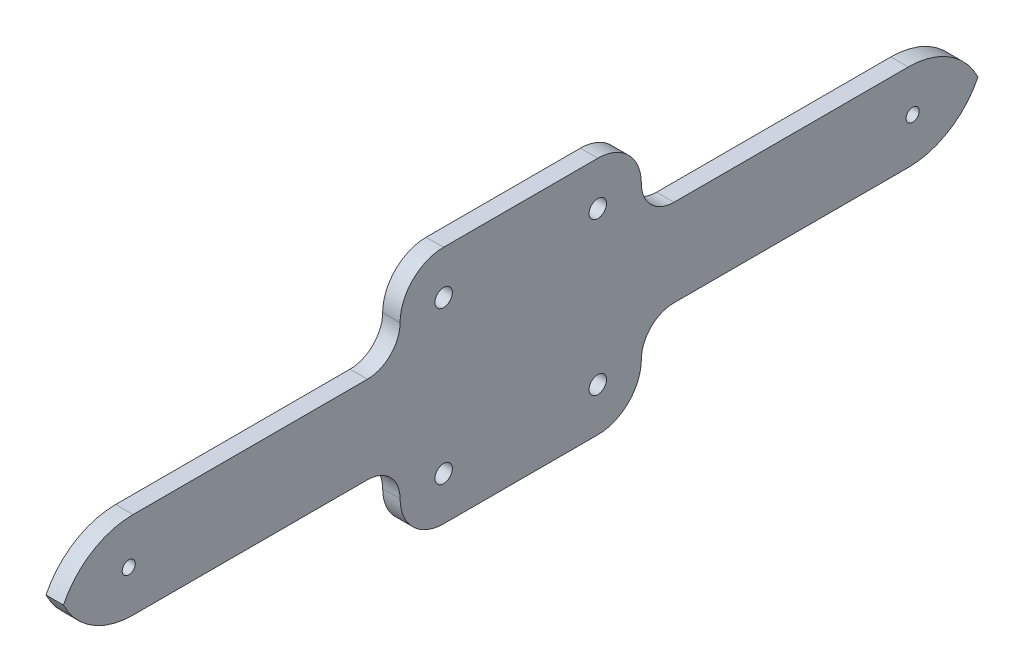
ISO-10303-21;
HEADER;
FILE_DESCRIPTION(('STEP AP214'),'2;1');
FILE_NAME('part.step','',(''),(''),'','','');
FILE_SCHEMA(('AUTOMOTIVE_DESIGN { 1 0 10303 214 1 1 1 1 }'));
ENDSEC;
DATA;
#1=APPLICATION_CONTEXT('core data for automotive mechanical design processes');
#2=APPLICATION_PROTOCOL_DEFINITION('international standard','automotive_design',2000,#1);
#3=PRODUCT_CONTEXT('',#1,'mechanical');
#4=PRODUCT('Part','Part','',(#3));
#5=PRODUCT_RELATED_PRODUCT_CATEGORY('part','',(#4));
#6=PRODUCT_DEFINITION_FORMATION('','',#4);
#7=PRODUCT_DEFINITION_CONTEXT('part definition',#1,'design');
#8=PRODUCT_DEFINITION('design','',#6,#7);
#9=PRODUCT_DEFINITION_SHAPE('','',#8);
#10=(LENGTH_UNIT() NAMED_UNIT(*) SI_UNIT(.MILLI.,.METRE.));
#11=(NAMED_UNIT(*) PLANE_ANGLE_UNIT() SI_UNIT($,.RADIAN.));
#12=(NAMED_UNIT(*) SI_UNIT($,.STERADIAN.) SOLID_ANGLE_UNIT());
#13=UNCERTAINTY_MEASURE_WITH_UNIT(LENGTH_MEASURE(1.E-05),#10,'distance_accuracy_value','');
#14=(GEOMETRIC_REPRESENTATION_CONTEXT(3) GLOBAL_UNCERTAINTY_ASSIGNED_CONTEXT((#13)) GLOBAL_UNIT_ASSIGNED_CONTEXT((#10,
#11,#12)) REPRESENTATION_CONTEXT('',''));
#15=CARTESIAN_POINT('',(0.,0.,0.));
#16=DIRECTION('',(0.,0.,1.));
#17=DIRECTION('',(1.,0.,0.));
#18=AXIS2_PLACEMENT_3D('',#15,#16,#17);
#19=CARTESIAN_POINT('',(4.,0.,0.));
#20=DIRECTION('',(1.,0.,0.));
#21=DIRECTION('',(0.,0.,-1.));
#22=AXIS2_PLACEMENT_3D('',#19,#20,#21);
#23=PLANE('',#22);
#24=CARTESIAN_POINT('',(4.,7.80000000000001,-89.));
#25=DIRECTION('',(-1.,0.,0.));
#26=DIRECTION('',(0.,0.,-1.));
#27=AXIS2_PLACEMENT_3D('',#24,#25,#26);
#28=CIRCLE('',#27,17.8);
#29=CARTESIAN_POINT('',(4.,0.,-105.));
#30=VERTEX_POINT('',#29);
#31=CARTESIAN_POINT('',(4.,-10.,-89.));
#32=VERTEX_POINT('',#31);
#33=EDGE_CURVE('E175',#30,#32,#28,.T.);
#34=ORIENTED_EDGE('',*,*,#33,.F.);
#35=CARTESIAN_POINT('',(4.,-7.80000000000001,-89.));
#36=DIRECTION('',(1.,0.,0.));
#37=DIRECTION('',(0.,0.,-1.));
#38=AXIS2_PLACEMENT_3D('',#35,#36,#37);
#39=CIRCLE('',#38,17.8);
#40=CARTESIAN_POINT('',(4.,10.,-89.));
#41=VERTEX_POINT('',#40);
#42=EDGE_CURVE('E218',#30,#41,#39,.T.);
#43=ORIENTED_EDGE('',*,*,#42,.T.);
#44=DIRECTION('',(0.,0.,1.));
#45=VECTOR('',#44,1.);
#46=CARTESIAN_POINT('',(4.,10.,-89.));
#47=LINE('',#46,#45);
#48=CARTESIAN_POINT('',(4.,10.,-35.2));
#49=VERTEX_POINT('',#48);
#50=EDGE_CURVE('E223',#41,#49,#47,.T.);
#51=ORIENTED_EDGE('',*,*,#50,.T.);
#52=CARTESIAN_POINT('',(4.,17.5,-35.2));
#53=DIRECTION('',(-1.,0.,0.));
#54=DIRECTION('',(0.,0.,1.));
#55=AXIS2_PLACEMENT_3D('',#52,#53,#54);
#56=CIRCLE('',#55,7.5);
#57=CARTESIAN_POINT('',(4.,17.5,-27.7));
#58=VERTEX_POINT('',#57);
#59=EDGE_CURVE('E236',#49,#58,#56,.T.);
#60=ORIENTED_EDGE('',*,*,#59,.T.);
#61=CARTESIAN_POINT('',(4.,17.5,-17.7));
#62=DIRECTION('',(1.,0.,0.));
#63=DIRECTION('',(0.,0.,1.));
#64=AXIS2_PLACEMENT_3D('',#61,#62,#63);
#65=CIRCLE('',#64,10.);
#66=CARTESIAN_POINT('',(4.,27.5,-17.7));
#67=VERTEX_POINT('',#66);
#68=EDGE_CURVE('E233',#58,#67,#65,.T.);
#69=ORIENTED_EDGE('',*,*,#68,.T.);
#70=DIRECTION('',(0.,0.,-1.));
#71=VECTOR('',#70,1.);
#72=CARTESIAN_POINT('',(4.,27.5,17.7));
#73=LINE('',#72,#71);
#74=CARTESIAN_POINT('',(4.,27.5,17.7));
#75=VERTEX_POINT('',#74);
#76=EDGE_CURVE('E305',#75,#67,#73,.T.);
#77=ORIENTED_EDGE('',*,*,#76,.F.);
#78=CARTESIAN_POINT('',(4.,17.5,17.7));
#79=DIRECTION('',(-1.,0.,0.));
#80=DIRECTION('',(0.,0.,-1.));
#81=AXIS2_PLACEMENT_3D('',#78,#79,#80);
#82=CIRCLE('',#81,10.);
#83=CARTESIAN_POINT('',(4.,17.5,27.7));
#84=VERTEX_POINT('',#83);
#85=EDGE_CURVE('E321',#84,#75,#82,.T.);
#86=ORIENTED_EDGE('',*,*,#85,.F.);
#87=CARTESIAN_POINT('',(4.,17.5,35.2));
#88=DIRECTION('',(1.,0.,0.));
#89=DIRECTION('',(0.,0.,-1.));
#90=AXIS2_PLACEMENT_3D('',#87,#88,#89);
#91=CIRCLE('',#90,7.5);
#92=CARTESIAN_POINT('',(4.,10.,35.2));
#93=VERTEX_POINT('',#92);
#94=EDGE_CURVE('E318',#93,#84,#91,.T.);
#95=ORIENTED_EDGE('',*,*,#94,.F.);
#96=DIRECTION('',(0.,0.,-1.));
#97=VECTOR('',#96,1.);
#98=CARTESIAN_POINT('',(4.,10.,89.));
#99=LINE('',#98,#97);
#100=CARTESIAN_POINT('',(4.,10.,89.));
#101=VERTEX_POINT('',#100);
#102=EDGE_CURVE('E315',#101,#93,#99,.T.);
#103=ORIENTED_EDGE('',*,*,#102,.F.);
#104=CARTESIAN_POINT('',(4.,-7.80000000000001,89.));
#105=DIRECTION('',(-1.,0.,0.));
#106=DIRECTION('',(0.,0.,1.));
#107=AXIS2_PLACEMENT_3D('',#104,#105,#106);
#108=CIRCLE('',#107,17.8);
#109=CARTESIAN_POINT('',(4.,0.,105.));
#110=VERTEX_POINT('',#109);
#111=EDGE_CURVE('E298',#110,#101,#108,.T.);
#112=ORIENTED_EDGE('',*,*,#111,.F.);
#113=CARTESIAN_POINT('',(4.,7.80000000000001,89.));
#114=DIRECTION('',(1.,0.,0.));
#115=DIRECTION('',(0.,0.,1.));
#116=AXIS2_PLACEMENT_3D('',#113,#114,#115);
#117=CIRCLE('',#116,17.8);
#118=CARTESIAN_POINT('',(4.,-10.,89.));
#119=VERTEX_POINT('',#118);
#120=EDGE_CURVE('E79',#110,#119,#117,.T.);
#121=ORIENTED_EDGE('',*,*,#120,.T.);
#122=DIRECTION('',(0.,0.,-1.));
#123=VECTOR('',#122,1.);
#124=CARTESIAN_POINT('',(4.,-10.,89.));
#125=LINE('',#124,#123);
#126=CARTESIAN_POINT('',(4.,-10.,35.2));
#127=VERTEX_POINT('',#126);
#128=EDGE_CURVE('E267',#119,#127,#125,.T.);
#129=ORIENTED_EDGE('',*,*,#128,.T.);
#130=CARTESIAN_POINT('',(4.,-17.5,35.2));
#131=DIRECTION('',(-1.,0.,0.));
#132=DIRECTION('',(0.,0.,-1.));
#133=AXIS2_PLACEMENT_3D('',#130,#131,#132);
#134=CIRCLE('',#133,7.5);
#135=CARTESIAN_POINT('',(4.,-17.5,27.7));
#136=VERTEX_POINT('',#135);
#137=EDGE_CURVE('E282',#127,#136,#134,.T.);
#138=ORIENTED_EDGE('',*,*,#137,.T.);
#139=CARTESIAN_POINT('',(4.,-17.5,17.7));
#140=DIRECTION('',(1.,0.,0.));
#141=DIRECTION('',(0.,0.,-1.));
#142=AXIS2_PLACEMENT_3D('',#139,#140,#141);
#143=CIRCLE('',#142,10.);
#144=CARTESIAN_POINT('',(4.,-27.5,17.7));
#145=VERTEX_POINT('',#144);
#146=EDGE_CURVE('E279',#136,#145,#143,.T.);
#147=ORIENTED_EDGE('',*,*,#146,.T.);
#148=DIRECTION('',(0.,0.,-1.));
#149=VECTOR('',#148,1.);
#150=CARTESIAN_POINT('',(4.,-27.5,17.7));
#151=LINE('',#150,#149);
#152=CARTESIAN_POINT('',(4.,-27.5,-17.7));
#153=VERTEX_POINT('',#152);
#154=EDGE_CURVE('E277',#145,#153,#151,.T.);
#155=ORIENTED_EDGE('',*,*,#154,.T.);
#156=CARTESIAN_POINT('',(4.,-17.5,-17.7));
#157=DIRECTION('',(-1.,0.,0.));
#158=DIRECTION('',(0.,0.,1.));
#159=AXIS2_PLACEMENT_3D('',#156,#157,#158);
#160=CIRCLE('',#159,10.);
#161=CARTESIAN_POINT('',(4.,-17.5,-27.7));
#162=VERTEX_POINT('',#161);
#163=EDGE_CURVE('E194',#162,#153,#160,.T.);
#164=ORIENTED_EDGE('',*,*,#163,.F.);
#165=CARTESIAN_POINT('',(4.,-17.5,-35.2));
#166=DIRECTION('',(1.,0.,0.));
#167=DIRECTION('',(0.,0.,1.));
#168=AXIS2_PLACEMENT_3D('',#165,#166,#167);
#169=CIRCLE('',#168,7.5);
#170=CARTESIAN_POINT('',(4.,-10.,-35.2));
#171=VERTEX_POINT('',#170);
#172=EDGE_CURVE('E197',#171,#162,#169,.T.);
#173=ORIENTED_EDGE('',*,*,#172,.F.);
#174=DIRECTION('',(0.,0.,1.));
#175=VECTOR('',#174,1.);
#176=CARTESIAN_POINT('',(4.,-10.,-89.));
#177=LINE('',#176,#175);
#178=EDGE_CURVE('E204',#32,#171,#177,.T.);
#179=ORIENTED_EDGE('',*,*,#178,.F.);
#180=EDGE_LOOP('',(#34,#43,#51,#60,#69,#77,#86,#95,#103,#112,#121,#129,#138,#147,#155,#164,#173,#179));
#181=FACE_BOUND('',#180,.T.);
#182=CARTESIAN_POINT('',(4.,-17.5,-17.7));
#183=DIRECTION('',(1.,0.,0.));
#184=DIRECTION('',(0.,0.,1.));
#185=AXIS2_PLACEMENT_3D('',#182,#183,#184);
#186=CIRCLE('',#185,2.);
#187=CARTESIAN_POINT('',(4.,-17.5,-15.7));
#188=VERTEX_POINT('',#187);
#189=EDGE_CURVE('E211',#188,#188,#186,.T.);
#190=ORIENTED_EDGE('',*,*,#189,.F.);
#191=EDGE_LOOP('',(#190));
#192=FACE_BOUND('',#191,.T.);
#193=CARTESIAN_POINT('',(4.,17.5,-17.7));
#194=DIRECTION('',(-1.,0.,0.));
#195=DIRECTION('',(0.,0.,1.));
#196=AXIS2_PLACEMENT_3D('',#193,#194,#195);
#197=CIRCLE('',#196,2.);
#198=CARTESIAN_POINT('',(4.,17.5,-15.7));
#199=VERTEX_POINT('',#198);
#200=EDGE_CURVE('E244',#199,#199,#197,.T.);
#201=ORIENTED_EDGE('',*,*,#200,.T.);
#202=EDGE_LOOP('',(#201));
#203=FACE_BOUND('',#202,.T.);
#204=CARTESIAN_POINT('',(4.,0.,-90.));
#205=DIRECTION('',(-1.,0.,0.));
#206=DIRECTION('',(0.,0.,1.));
#207=AXIS2_PLACEMENT_3D('',#204,#205,#206);
#208=CIRCLE('',#207,1.5);
#209=CARTESIAN_POINT('',(4.,0.,-88.5));
#210=VERTEX_POINT('',#209);
#211=EDGE_CURVE('E256',#210,#210,#208,.T.);
#212=ORIENTED_EDGE('',*,*,#211,.T.);
#213=EDGE_LOOP('',(#212));
#214=FACE_BOUND('',#213,.T.);
#215=CARTESIAN_POINT('',(4.,-17.5,17.7));
#216=DIRECTION('',(-1.,0.,0.));
#217=DIRECTION('',(0.,0.,-1.));
#218=AXIS2_PLACEMENT_3D('',#215,#216,#217);
#219=CIRCLE('',#218,2.);
#220=CARTESIAN_POINT('',(4.,-17.5,15.7));
#221=VERTEX_POINT('',#220);
#222=EDGE_CURVE('E289',#221,#221,#219,.T.);
#223=ORIENTED_EDGE('',*,*,#222,.T.);
#224=EDGE_LOOP('',(#223));
#225=FACE_BOUND('',#224,.T.);
#226=CARTESIAN_POINT('',(4.,17.5,17.7));
#227=DIRECTION('',(1.,0.,0.));
#228=DIRECTION('',(0.,0.,-1.));
#229=AXIS2_PLACEMENT_3D('',#226,#227,#228);
#230=CIRCLE('',#229,2.);
#231=CARTESIAN_POINT('',(4.,17.5,15.7));
#232=VERTEX_POINT('',#231);
#233=EDGE_CURVE('E326',#232,#232,#230,.T.);
#234=ORIENTED_EDGE('',*,*,#233,.F.);
#235=EDGE_LOOP('',(#234));
#236=FACE_BOUND('',#235,.T.);
#237=CARTESIAN_POINT('',(4.,0.,90.));
#238=DIRECTION('',(1.,0.,0.));
#239=DIRECTION('',(0.,0.,-1.));
#240=AXIS2_PLACEMENT_3D('',#237,#238,#239);
#241=CIRCLE('',#240,1.5);
#242=CARTESIAN_POINT('',(4.,0.,88.5));
#243=VERTEX_POINT('',#242);
#244=EDGE_CURVE('E37',#243,#243,#241,.T.);
#245=ORIENTED_EDGE('',*,*,#244,.F.);
#246=EDGE_LOOP('',(#245));
#247=FACE_BOUND('',#246,.T.);
#248=ADVANCED_FACE('F33',(#181,#192,#203,#214,#225,#236,#247),#23,.T.);
#249=CARTESIAN_POINT('',(0.,0.,0.));
#250=DIRECTION('',(1.,0.,0.));
#251=DIRECTION('',(0.,0.,-1.));
#252=AXIS2_PLACEMENT_3D('',#249,#250,#251);
#253=PLANE('',#252);
#254=CARTESIAN_POINT('',(0.,-7.80000000000001,-89.));
#255=DIRECTION('',(1.,0.,0.));
#256=DIRECTION('',(0.,0.,-1.));
#257=AXIS2_PLACEMENT_3D('',#254,#255,#256);
#258=CIRCLE('',#257,17.8);
#259=CARTESIAN_POINT('',(0.,0.,-105.));
#260=VERTEX_POINT('',#259);
#261=CARTESIAN_POINT('',(0.,10.,-89.));
#262=VERTEX_POINT('',#261);
#263=EDGE_CURVE('E193',#260,#262,#258,.T.);
#264=ORIENTED_EDGE('',*,*,#263,.F.);
#265=CARTESIAN_POINT('',(0.,7.80000000000001,-89.));
#266=DIRECTION('',(-1.,0.,0.));
#267=DIRECTION('',(0.,0.,-1.));
#268=AXIS2_PLACEMENT_3D('',#265,#266,#267);
#269=CIRCLE('',#268,17.8);
#270=CARTESIAN_POINT('',(0.,-10.,-89.));
#271=VERTEX_POINT('',#270);
#272=EDGE_CURVE('E172',#260,#271,#269,.T.);
#273=ORIENTED_EDGE('',*,*,#272,.T.);
#274=DIRECTION('',(0.,0.,1.));
#275=VECTOR('',#274,1.);
#276=CARTESIAN_POINT('',(0.,-10.,-89.));
#277=LINE('',#276,#275);
#278=CARTESIAN_POINT('',(0.,-10.,-35.2));
#279=VERTEX_POINT('',#278);
#280=EDGE_CURVE('E183',#271,#279,#277,.T.);
#281=ORIENTED_EDGE('',*,*,#280,.T.);
#282=CARTESIAN_POINT('',(0.,-17.5,-35.2));
#283=DIRECTION('',(1.,0.,0.));
#284=DIRECTION('',(0.,0.,1.));
#285=AXIS2_PLACEMENT_3D('',#282,#283,#284);
#286=CIRCLE('',#285,7.5);
#287=CARTESIAN_POINT('',(0.,-17.5,-27.7));
#288=VERTEX_POINT('',#287);
#289=EDGE_CURVE('E188',#279,#288,#286,.T.);
#290=ORIENTED_EDGE('',*,*,#289,.T.);
#291=CARTESIAN_POINT('',(0.,-17.5,-17.7));
#292=DIRECTION('',(-1.,0.,0.));
#293=DIRECTION('',(0.,0.,1.));
#294=AXIS2_PLACEMENT_3D('',#291,#292,#293);
#295=CIRCLE('',#294,10.);
#296=CARTESIAN_POINT('',(0.,-27.5,-17.7));
#297=VERTEX_POINT('',#296);
#298=EDGE_CURVE('E180',#288,#297,#295,.T.);
#299=ORIENTED_EDGE('',*,*,#298,.T.);
#300=DIRECTION('',(0.,0.,-1.));
#301=VECTOR('',#300,1.);
#302=CARTESIAN_POINT('',(0.,-27.5,17.7));
#303=LINE('',#302,#301);
#304=CARTESIAN_POINT('',(0.,-27.5,17.7));
#305=VERTEX_POINT('',#304);
#306=EDGE_CURVE('E266',#305,#297,#303,.T.);
#307=ORIENTED_EDGE('',*,*,#306,.F.);
#308=CARTESIAN_POINT('',(0.,-17.5,17.7));
#309=DIRECTION('',(1.,0.,0.));
#310=DIRECTION('',(0.,0.,-1.));
#311=AXIS2_PLACEMENT_3D('',#308,#309,#310);
#312=CIRCLE('',#311,10.);
#313=CARTESIAN_POINT('',(0.,-17.5,27.7));
#314=VERTEX_POINT('',#313);
#315=EDGE_CURVE('E269',#314,#305,#312,.T.);
#316=ORIENTED_EDGE('',*,*,#315,.F.);
#317=CARTESIAN_POINT('',(0.,-17.5,35.2));
#318=DIRECTION('',(-1.,0.,0.));
#319=DIRECTION('',(0.,0.,-1.));
#320=AXIS2_PLACEMENT_3D('',#317,#318,#319);
#321=CIRCLE('',#320,7.5);
#322=CARTESIAN_POINT('',(0.,-10.,35.2));
#323=VERTEX_POINT('',#322);
#324=EDGE_CURVE('E271',#323,#314,#321,.T.);
#325=ORIENTED_EDGE('',*,*,#324,.F.);
#326=DIRECTION('',(0.,0.,-1.));
#327=VECTOR('',#326,1.);
#328=CARTESIAN_POINT('',(0.,-10.,89.));
#329=LINE('',#328,#327);
#330=CARTESIAN_POINT('',(0.,-10.,89.));
#331=VERTEX_POINT('',#330);
#332=EDGE_CURVE('E273',#331,#323,#329,.T.);
#333=ORIENTED_EDGE('',*,*,#332,.F.);
#334=CARTESIAN_POINT('',(0.,7.80000000000001,89.));
#335=DIRECTION('',(1.,0.,0.));
#336=DIRECTION('',(0.,0.,1.));
#337=AXIS2_PLACEMENT_3D('',#334,#335,#336);
#338=CIRCLE('',#337,17.8);
#339=CARTESIAN_POINT('',(0.,0.,105.));
#340=VERTEX_POINT('',#339);
#341=EDGE_CURVE('E264',#340,#331,#338,.T.);
#342=ORIENTED_EDGE('',*,*,#341,.F.);
#343=CARTESIAN_POINT('',(0.,-7.80000000000001,89.));
#344=DIRECTION('',(-1.,0.,0.));
#345=DIRECTION('',(0.,0.,1.));
#346=AXIS2_PLACEMENT_3D('',#343,#344,#345);
#347=CIRCLE('',#346,17.8);
#348=CARTESIAN_POINT('',(0.,10.,89.));
#349=VERTEX_POINT('',#348);
#350=EDGE_CURVE('E301',#340,#349,#347,.T.);
#351=ORIENTED_EDGE('',*,*,#350,.T.);
#352=DIRECTION('',(0.,0.,-1.));
#353=VECTOR('',#352,1.);
#354=CARTESIAN_POINT('',(0.,10.,89.));
#355=LINE('',#354,#353);
#356=CARTESIAN_POINT('',(0.,10.,35.2));
#357=VERTEX_POINT('',#356);
#358=EDGE_CURVE('E304',#349,#357,#355,.T.);
#359=ORIENTED_EDGE('',*,*,#358,.T.);
#360=CARTESIAN_POINT('',(0.,17.5,35.2));
#361=DIRECTION('',(1.,0.,0.));
#362=DIRECTION('',(0.,0.,-1.));
#363=AXIS2_PLACEMENT_3D('',#360,#361,#362);
#364=CIRCLE('',#363,7.5);
#365=CARTESIAN_POINT('',(0.,17.5,27.7));
#366=VERTEX_POINT('',#365);
#367=EDGE_CURVE('E48',#357,#366,#364,.T.);
#368=ORIENTED_EDGE('',*,*,#367,.T.);
#369=CARTESIAN_POINT('',(0.,17.5,17.7));
#370=DIRECTION('',(-1.,0.,0.));
#371=DIRECTION('',(0.,0.,-1.));
#372=AXIS2_PLACEMENT_3D('',#369,#370,#371);
#373=CIRCLE('',#372,10.);
#374=CARTESIAN_POINT('',(0.,27.5,17.7));
#375=VERTEX_POINT('',#374);
#376=EDGE_CURVE('E309',#366,#375,#373,.T.);
#377=ORIENTED_EDGE('',*,*,#376,.T.);
#378=DIRECTION('',(0.,0.,-1.));
#379=VECTOR('',#378,1.);
#380=CARTESIAN_POINT('',(0.,27.5,17.7));
#381=LINE('',#380,#379);
#382=CARTESIAN_POINT('',(0.,27.5,-17.7));
#383=VERTEX_POINT('',#382);
#384=EDGE_CURVE('E312',#375,#383,#381,.T.);
#385=ORIENTED_EDGE('',*,*,#384,.T.);
#386=CARTESIAN_POINT('',(0.,17.5,-17.7));
#387=DIRECTION('',(1.,0.,0.));
#388=DIRECTION('',(0.,0.,1.));
#389=AXIS2_PLACEMENT_3D('',#386,#387,#388);
#390=CIRCLE('',#389,10.);
#391=CARTESIAN_POINT('',(0.,17.5,-27.7));
#392=VERTEX_POINT('',#391);
#393=EDGE_CURVE('E222',#392,#383,#390,.T.);
#394=ORIENTED_EDGE('',*,*,#393,.F.);
#395=CARTESIAN_POINT('',(0.,17.5,-35.2));
#396=DIRECTION('',(-1.,0.,0.));
#397=DIRECTION('',(0.,0.,1.));
#398=AXIS2_PLACEMENT_3D('',#395,#396,#397);
#399=CIRCLE('',#398,7.5);
#400=CARTESIAN_POINT('',(0.,10.,-35.2));
#401=VERTEX_POINT('',#400);
#402=EDGE_CURVE('E226',#401,#392,#399,.T.);
#403=ORIENTED_EDGE('',*,*,#402,.F.);
#404=DIRECTION('',(0.,0.,1.));
#405=VECTOR('',#404,1.);
#406=CARTESIAN_POINT('',(0.,10.,-89.));
#407=LINE('',#406,#405);
#408=EDGE_CURVE('E228',#262,#401,#407,.T.);
#409=ORIENTED_EDGE('',*,*,#408,.F.);
#410=EDGE_LOOP('',(#264,#273,#281,#290,#299,#307,#316,#325,#333,#342,#351,#359,#368,#377,#385,
#394,#403,#409));
#411=FACE_BOUND('',#410,.T.);
#412=CARTESIAN_POINT('',(0.,-17.5,-17.7));
#413=DIRECTION('',(1.,0.,0.));
#414=DIRECTION('',(0.,0.,1.));
#415=AXIS2_PLACEMENT_3D('',#412,#413,#414);
#416=CIRCLE('',#415,2.);
#417=CARTESIAN_POINT('',(0.,-17.5,-15.7));
#418=VERTEX_POINT('',#417);
#419=EDGE_CURVE('E215',#418,#418,#416,.T.);
#420=ORIENTED_EDGE('',*,*,#419,.T.);
#421=EDGE_LOOP('',(#420));
#422=FACE_BOUND('',#421,.T.);
#423=CARTESIAN_POINT('',(0.,-17.5,17.7));
#424=DIRECTION('',(-1.,0.,0.));
#425=DIRECTION('',(0.,0.,-1.));
#426=AXIS2_PLACEMENT_3D('',#423,#424,#425);
#427=CIRCLE('',#426,2.);
#428=CARTESIAN_POINT('',(0.,-17.5,15.7));
#429=VERTEX_POINT('',#428);
#430=EDGE_CURVE('E295',#429,#429,#427,.T.);
#431=ORIENTED_EDGE('',*,*,#430,.F.);
#432=EDGE_LOOP('',(#431));
#433=FACE_BOUND('',#432,.T.);
#434=CARTESIAN_POINT('',(0.,17.5,17.7));
#435=DIRECTION('',(1.,0.,0.));
#436=DIRECTION('',(0.,0.,-1.));
#437=AXIS2_PLACEMENT_3D('',#434,#435,#436);
#438=CIRCLE('',#437,2.);
#439=CARTESIAN_POINT('',(0.,17.5,15.7));
#440=VERTEX_POINT('',#439);
#441=EDGE_CURVE('E333',#440,#440,#438,.T.);
#442=ORIENTED_EDGE('',*,*,#441,.T.);
#443=EDGE_LOOP('',(#442));
#444=FACE_BOUND('',#443,.T.);
#445=CARTESIAN_POINT('',(0.,0.,90.));
#446=DIRECTION('',(1.,0.,0.));
#447=DIRECTION('',(0.,0.,-1.));
#448=AXIS2_PLACEMENT_3D('',#445,#446,#447);
#449=CIRCLE('',#448,1.5);
#450=CARTESIAN_POINT('',(0.,0.,88.5));
#451=VERTEX_POINT('',#450);
#452=EDGE_CURVE('E11',#451,#451,#449,.T.);
#453=ORIENTED_EDGE('',*,*,#452,.T.);
#454=EDGE_LOOP('',(#453));
#455=FACE_BOUND('',#454,.T.);
#456=CARTESIAN_POINT('',(0.,0.,-90.));
#457=DIRECTION('',(-1.,0.,0.));
#458=DIRECTION('',(0.,0.,1.));
#459=AXIS2_PLACEMENT_3D('',#456,#457,#458);
#460=CIRCLE('',#459,1.5);
#461=CARTESIAN_POINT('',(0.,0.,-88.5));
#462=VERTEX_POINT('',#461);
#463=EDGE_CURVE('E259',#462,#462,#460,.T.);
#464=ORIENTED_EDGE('',*,*,#463,.F.);
#465=EDGE_LOOP('',(#464));
#466=FACE_BOUND('',#465,.T.);
#467=CARTESIAN_POINT('',(0.,17.5,-17.7));
#468=DIRECTION('',(-1.,0.,0.));
#469=DIRECTION('',(0.,0.,1.));
#470=AXIS2_PLACEMENT_3D('',#467,#468,#469);
#471=CIRCLE('',#470,2.);
#472=CARTESIAN_POINT('',(0.,17.5,-15.7));
#473=VERTEX_POINT('',#472);
#474=EDGE_CURVE('E253',#473,#473,#471,.T.);
#475=ORIENTED_EDGE('',*,*,#474,.F.);
#476=EDGE_LOOP('',(#475));
#477=FACE_BOUND('',#476,.T.);
#478=ADVANCED_FACE('F35',(#411,#422,#433,#444,#455,#466,#477),#253,.F.);
#479=CARTESIAN_POINT('',(0.,0.,90.));
#480=DIRECTION('',(1.,0.,0.));
#481=DIRECTION('',(0.,0.,-1.));
#482=AXIS2_PLACEMENT_3D('',#479,#480,#481);
#483=CYLINDRICAL_SURFACE('',#482,1.5);
#484=ORIENTED_EDGE('',*,*,#452,.F.);
#485=EDGE_LOOP('',(#484));
#486=FACE_BOUND('',#485,.T.);
#487=ORIENTED_EDGE('',*,*,#244,.T.);
#488=EDGE_LOOP('',(#487));
#489=FACE_BOUND('',#488,.T.);
#490=ADVANCED_FACE('F347',(#486,#489),#483,.F.);
#491=CARTESIAN_POINT('',(0.,17.5,17.7));
#492=DIRECTION('',(1.,0.,0.));
#493=DIRECTION('',(0.,0.,-1.));
#494=AXIS2_PLACEMENT_3D('',#491,#492,#493);
#495=CYLINDRICAL_SURFACE('',#494,2.);
#496=ORIENTED_EDGE('',*,*,#441,.F.);
#497=EDGE_LOOP('',(#496));
#498=FACE_BOUND('',#497,.T.);
#499=ORIENTED_EDGE('',*,*,#233,.T.);
#500=EDGE_LOOP('',(#499));
#501=FACE_BOUND('',#500,.T.);
#502=ADVANCED_FACE('F339',(#498,#501),#495,.F.);
#503=CARTESIAN_POINT('',(0.,-7.80000000000001,89.));
#504=DIRECTION('',(1.,0.,0.));
#505=DIRECTION('',(0.,0.,-1.));
#506=AXIS2_PLACEMENT_3D('',#503,#504,#505);
#507=CYLINDRICAL_SURFACE('',#506,17.8);
#508=ORIENTED_EDGE('',*,*,#111,.T.);
#509=DIRECTION('',(1.,0.,0.));
#510=VECTOR('',#509,1.);
#511=CARTESIAN_POINT('',(0.,10.,89.));
#512=LINE('',#511,#510);
#513=EDGE_CURVE('E85',#349,#101,#512,.T.);
#514=ORIENTED_EDGE('',*,*,#513,.F.);
#515=ORIENTED_EDGE('',*,*,#350,.F.);
#516=DIRECTION('',(1.,0.,0.));
#517=VECTOR('',#516,1.);
#518=CARTESIAN_POINT('',(0.,0.,105.));
#519=LINE('',#518,#517);
#520=EDGE_CURVE('E324',#340,#110,#519,.T.);
#521=ORIENTED_EDGE('',*,*,#520,.T.);
#522=EDGE_LOOP('',(#508,#514,#515,#521));
#523=FACE_BOUND('',#522,.T.);
#524=ADVANCED_FACE('F355',(#523),#507,.T.);
#525=CARTESIAN_POINT('',(0.,27.5,17.7));
#526=DIRECTION('',(0.,-1.,0.));
#527=DIRECTION('',(0.,0.,-1.));
#528=AXIS2_PLACEMENT_3D('',#525,#526,#527);
#529=PLANE('',#528);
#530=ORIENTED_EDGE('',*,*,#76,.T.);
#531=DIRECTION('',(1.,0.,0.));
#532=VECTOR('',#531,1.);
#533=CARTESIAN_POINT('',(0.,27.5,-17.7));
#534=LINE('',#533,#532);
#535=EDGE_CURVE('E249',#383,#67,#534,.T.);
#536=ORIENTED_EDGE('',*,*,#535,.F.);
#537=ORIENTED_EDGE('',*,*,#384,.F.);
#538=DIRECTION('',(1.,0.,0.));
#539=VECTOR('',#538,1.);
#540=CARTESIAN_POINT('',(0.,27.5,17.7));
#541=LINE('',#540,#539);
#542=EDGE_CURVE('E57',#375,#75,#541,.T.);
#543=ORIENTED_EDGE('',*,*,#542,.T.);
#544=EDGE_LOOP('',(#530,#536,#537,#543));
#545=FACE_BOUND('',#544,.T.);
#546=ADVANCED_FACE('F362',(#545),#529,.F.);
#547=CARTESIAN_POINT('',(0.,17.5,17.7));
#548=DIRECTION('',(1.,0.,0.));
#549=DIRECTION('',(0.,0.,-1.));
#550=AXIS2_PLACEMENT_3D('',#547,#548,#549);
#551=CYLINDRICAL_SURFACE('',#550,10.);
#552=ORIENTED_EDGE('',*,*,#85,.T.);
#553=ORIENTED_EDGE('',*,*,#542,.F.);
#554=ORIENTED_EDGE('',*,*,#376,.F.);
#555=DIRECTION('',(1.,0.,0.));
#556=VECTOR('',#555,1.);
#557=CARTESIAN_POINT('',(0.,17.5,27.7));
#558=LINE('',#557,#556);
#559=EDGE_CURVE('E328',#366,#84,#558,.T.);
#560=ORIENTED_EDGE('',*,*,#559,.T.);
#561=EDGE_LOOP('',(#552,#553,#554,#560));
#562=FACE_BOUND('',#561,.T.);
#563=ADVANCED_FACE('F371',(#562),#551,.T.);
#564=CARTESIAN_POINT('',(0.,17.5,35.2));
#565=DIRECTION('',(1.,0.,0.));
#566=DIRECTION('',(0.,0.,-1.));
#567=AXIS2_PLACEMENT_3D('',#564,#565,#566);
#568=CYLINDRICAL_SURFACE('',#567,7.5);
#569=ORIENTED_EDGE('',*,*,#94,.T.);
#570=ORIENTED_EDGE('',*,*,#559,.F.);
#571=ORIENTED_EDGE('',*,*,#367,.F.);
#572=DIRECTION('',(1.,0.,0.));
#573=VECTOR('',#572,1.);
#574=CARTESIAN_POINT('',(0.,10.,35.2));
#575=LINE('',#574,#573);
#576=EDGE_CURVE('E330',#357,#93,#575,.T.);
#577=ORIENTED_EDGE('',*,*,#576,.T.);
#578=EDGE_LOOP('',(#569,#570,#571,#577));
#579=FACE_BOUND('',#578,.T.);
#580=ADVANCED_FACE('F367',(#579),#568,.F.);
#581=CARTESIAN_POINT('',(0.,10.,89.));
#582=DIRECTION('',(0.,-1.,0.));
#583=DIRECTION('',(0.,0.,-1.));
#584=AXIS2_PLACEMENT_3D('',#581,#582,#583);
#585=PLANE('',#584);
#586=ORIENTED_EDGE('',*,*,#102,.T.);
#587=ORIENTED_EDGE('',*,*,#576,.F.);
#588=ORIENTED_EDGE('',*,*,#358,.F.);
#589=ORIENTED_EDGE('',*,*,#513,.T.);
#590=EDGE_LOOP('',(#586,#587,#588,#589));
#591=FACE_BOUND('',#590,.T.);
#592=ADVANCED_FACE('F363',(#591),#585,.F.);
#593=CARTESIAN_POINT('',(0.,-17.5,17.7));
#594=DIRECTION('',(1.,0.,0.));
#595=DIRECTION('',(0.,0.,-1.));
#596=AXIS2_PLACEMENT_3D('',#593,#594,#595);
#597=CYLINDRICAL_SURFACE('',#596,2.);
#598=ORIENTED_EDGE('',*,*,#430,.T.);
#599=EDGE_LOOP('',(#598));
#600=FACE_BOUND('',#599,.T.);
#601=ORIENTED_EDGE('',*,*,#222,.F.);
#602=EDGE_LOOP('',(#601));
#603=FACE_BOUND('',#602,.T.);
#604=ADVANCED_FACE('F366',(#600,#603),#597,.F.);
#605=CARTESIAN_POINT('',(0.,7.80000000000001,89.));
#606=DIRECTION('',(1.,0.,0.));
#607=DIRECTION('',(0.,0.,-1.));
#608=AXIS2_PLACEMENT_3D('',#605,#606,#607);
#609=CYLINDRICAL_SURFACE('',#608,17.8);
#610=ORIENTED_EDGE('',*,*,#120,.F.);
#611=ORIENTED_EDGE('',*,*,#520,.F.);
#612=ORIENTED_EDGE('',*,*,#341,.T.);
#613=DIRECTION('',(1.,0.,0.));
#614=VECTOR('',#613,1.);
#615=CARTESIAN_POINT('',(0.,-10.,89.));
#616=LINE('',#615,#614);
#617=EDGE_CURVE('E287',#331,#119,#616,.T.);
#618=ORIENTED_EDGE('',*,*,#617,.T.);
#619=EDGE_LOOP('',(#610,#611,#612,#618));
#620=FACE_BOUND('',#619,.T.);
#621=ADVANCED_FACE('F379',(#620),#609,.T.);
#622=CARTESIAN_POINT('',(0.,-10.,89.));
#623=DIRECTION('',(0.,-1.,0.));
#624=DIRECTION('',(0.,0.,-1.));
#625=AXIS2_PLACEMENT_3D('',#622,#623,#624);
#626=PLANE('',#625);
#627=ORIENTED_EDGE('',*,*,#128,.F.);
#628=ORIENTED_EDGE('',*,*,#617,.F.);
#629=ORIENTED_EDGE('',*,*,#332,.T.);
#630=DIRECTION('',(1.,0.,0.));
#631=VECTOR('',#630,1.);
#632=CARTESIAN_POINT('',(0.,-10.,35.2));
#633=LINE('',#632,#631);
#634=EDGE_CURVE('E290',#323,#127,#633,.T.);
#635=ORIENTED_EDGE('',*,*,#634,.T.);
#636=EDGE_LOOP('',(#627,#628,#629,#635));
#637=FACE_BOUND('',#636,.T.);
#638=ADVANCED_FACE('F383',(#637),#626,.T.);
#639=CARTESIAN_POINT('',(0.,-17.5,35.2));
#640=DIRECTION('',(1.,0.,0.));
#641=DIRECTION('',(0.,0.,-1.));
#642=AXIS2_PLACEMENT_3D('',#639,#640,#641);
#643=CYLINDRICAL_SURFACE('',#642,7.5);
#644=ORIENTED_EDGE('',*,*,#137,.F.);
#645=ORIENTED_EDGE('',*,*,#634,.F.);
#646=ORIENTED_EDGE('',*,*,#324,.T.);
#647=DIRECTION('',(1.,0.,0.));
#648=VECTOR('',#647,1.);
#649=CARTESIAN_POINT('',(0.,-17.5,27.7));
#650=LINE('',#649,#648);
#651=EDGE_CURVE('E292',#314,#136,#650,.T.);
#652=ORIENTED_EDGE('',*,*,#651,.T.);
#653=EDGE_LOOP('',(#644,#645,#646,#652));
#654=FACE_BOUND('',#653,.T.);
#655=ADVANCED_FACE('F392',(#654),#643,.F.);
#656=CARTESIAN_POINT('',(0.,-17.5,17.7));
#657=DIRECTION('',(1.,0.,0.));
#658=DIRECTION('',(0.,0.,-1.));
#659=AXIS2_PLACEMENT_3D('',#656,#657,#658);
#660=CYLINDRICAL_SURFACE('',#659,10.);
#661=ORIENTED_EDGE('',*,*,#146,.F.);
#662=ORIENTED_EDGE('',*,*,#651,.F.);
#663=ORIENTED_EDGE('',*,*,#315,.T.);
#664=DIRECTION('',(1.,0.,0.));
#665=VECTOR('',#664,1.);
#666=CARTESIAN_POINT('',(0.,-27.5,17.7));
#667=LINE('',#666,#665);
#668=EDGE_CURVE('E275',#305,#145,#667,.T.);
#669=ORIENTED_EDGE('',*,*,#668,.T.);
#670=EDGE_LOOP('',(#661,#662,#663,#669));
#671=FACE_BOUND('',#670,.T.);
#672=ADVANCED_FACE('F388',(#671),#660,.T.);
#673=CARTESIAN_POINT('',(0.,-27.5,17.7));
#674=DIRECTION('',(0.,-1.,0.));
#675=DIRECTION('',(0.,0.,-1.));
#676=AXIS2_PLACEMENT_3D('',#673,#674,#675);
#677=PLANE('',#676);
#678=ORIENTED_EDGE('',*,*,#154,.F.);
#679=ORIENTED_EDGE('',*,*,#668,.F.);
#680=ORIENTED_EDGE('',*,*,#306,.T.);
#681=DIRECTION('',(1.,0.,0.));
#682=VECTOR('',#681,1.);
#683=CARTESIAN_POINT('',(0.,-27.5,-17.7));
#684=LINE('',#683,#682);
#685=EDGE_CURVE('E208',#297,#153,#684,.T.);
#686=ORIENTED_EDGE('',*,*,#685,.T.);
#687=EDGE_LOOP('',(#678,#679,#680,#686));
#688=FACE_BOUND('',#687,.T.);
#689=ADVANCED_FACE('F384',(#688),#677,.T.);
#690=CARTESIAN_POINT('',(0.,0.,-90.));
#691=DIRECTION('',(1.,0.,0.));
#692=DIRECTION('',(0.,0.,-1.));
#693=AXIS2_PLACEMENT_3D('',#690,#691,#692);
#694=CYLINDRICAL_SURFACE('',#693,1.5);
#695=ORIENTED_EDGE('',*,*,#463,.T.);
#696=EDGE_LOOP('',(#695));
#697=FACE_BOUND('',#696,.T.);
#698=ORIENTED_EDGE('',*,*,#211,.F.);
#699=EDGE_LOOP('',(#698));
#700=FACE_BOUND('',#699,.T.);
#701=ADVANCED_FACE('F387',(#697,#700),#694,.F.);
#702=CARTESIAN_POINT('',(0.,17.5,-17.7));
#703=DIRECTION('',(1.,0.,0.));
#704=DIRECTION('',(0.,0.,-1.));
#705=AXIS2_PLACEMENT_3D('',#702,#703,#704);
#706=CYLINDRICAL_SURFACE('',#705,2.);
#707=ORIENTED_EDGE('',*,*,#474,.T.);
#708=EDGE_LOOP('',(#707));
#709=FACE_BOUND('',#708,.T.);
#710=ORIENTED_EDGE('',*,*,#200,.F.);
#711=EDGE_LOOP('',(#710));
#712=FACE_BOUND('',#711,.T.);
#713=ADVANCED_FACE('F402',(#709,#712),#706,.F.);
#714=CARTESIAN_POINT('',(0.,-7.80000000000001,-89.));
#715=DIRECTION('',(1.,0.,0.));
#716=DIRECTION('',(0.,0.,-1.));
#717=AXIS2_PLACEMENT_3D('',#714,#715,#716);
#718=CYLINDRICAL_SURFACE('',#717,17.8);
#719=ORIENTED_EDGE('',*,*,#42,.F.);
#720=DIRECTION('',(1.,0.,0.));
#721=VECTOR('',#720,1.);
#722=CARTESIAN_POINT('',(0.,0.,-105.));
#723=LINE('',#722,#721);
#724=EDGE_CURVE('E230',#260,#30,#723,.T.);
#725=ORIENTED_EDGE('',*,*,#724,.F.);
#726=ORIENTED_EDGE('',*,*,#263,.T.);
#727=DIRECTION('',(1.,0.,0.));
#728=VECTOR('',#727,1.);
#729=CARTESIAN_POINT('',(0.,10.,-89.));
#730=LINE('',#729,#728);
#731=EDGE_CURVE('E241',#262,#41,#730,.T.);
#732=ORIENTED_EDGE('',*,*,#731,.T.);
#733=EDGE_LOOP('',(#719,#725,#726,#732));
#734=FACE_BOUND('',#733,.T.);
#735=ADVANCED_FACE('F406',(#734),#718,.T.);
#736=CARTESIAN_POINT('',(0.,10.,-89.));
#737=DIRECTION('',(0.,1.,0.));
#738=DIRECTION('',(0.,0.,1.));
#739=AXIS2_PLACEMENT_3D('',#736,#737,#738);
#740=PLANE('',#739);
#741=ORIENTED_EDGE('',*,*,#50,.F.);
#742=ORIENTED_EDGE('',*,*,#731,.F.);
#743=ORIENTED_EDGE('',*,*,#408,.T.);
#744=DIRECTION('',(1.,0.,0.));
#745=VECTOR('',#744,1.);
#746=CARTESIAN_POINT('',(0.,10.,-35.2));
#747=LINE('',#746,#745);
#748=EDGE_CURVE('E245',#401,#49,#747,.T.);
#749=ORIENTED_EDGE('',*,*,#748,.T.);
#750=EDGE_LOOP('',(#741,#742,#743,#749));
#751=FACE_BOUND('',#750,.T.);
#752=ADVANCED_FACE('F410',(#751),#740,.T.);
#753=CARTESIAN_POINT('',(0.,17.5,-35.2));
#754=DIRECTION('',(1.,0.,0.));
#755=DIRECTION('',(0.,0.,-1.));
#756=AXIS2_PLACEMENT_3D('',#753,#754,#755);
#757=CYLINDRICAL_SURFACE('',#756,7.5);
#758=ORIENTED_EDGE('',*,*,#59,.F.);
#759=ORIENTED_EDGE('',*,*,#748,.F.);
#760=ORIENTED_EDGE('',*,*,#402,.T.);
#761=DIRECTION('',(1.,0.,0.));
#762=VECTOR('',#761,1.);
#763=CARTESIAN_POINT('',(0.,17.5,-27.7));
#764=LINE('',#763,#762);
#765=EDGE_CURVE('E247',#392,#58,#764,.T.);
#766=ORIENTED_EDGE('',*,*,#765,.T.);
#767=EDGE_LOOP('',(#758,#759,#760,#766));
#768=FACE_BOUND('',#767,.T.);
#769=ADVANCED_FACE('F416',(#768),#757,.F.);
#770=CARTESIAN_POINT('',(0.,17.5,-17.7));
#771=DIRECTION('',(1.,0.,0.));
#772=DIRECTION('',(0.,0.,-1.));
#773=AXIS2_PLACEMENT_3D('',#770,#771,#772);
#774=CYLINDRICAL_SURFACE('',#773,10.);
#775=ORIENTED_EDGE('',*,*,#68,.F.);
#776=ORIENTED_EDGE('',*,*,#765,.F.);
#777=ORIENTED_EDGE('',*,*,#393,.T.);
#778=ORIENTED_EDGE('',*,*,#535,.T.);
#779=EDGE_LOOP('',(#775,#776,#777,#778));
#780=FACE_BOUND('',#779,.T.);
#781=ADVANCED_FACE('F412',(#780),#774,.T.);
#782=CARTESIAN_POINT('',(0.,-17.5,-17.7));
#783=DIRECTION('',(1.,0.,0.));
#784=DIRECTION('',(0.,0.,-1.));
#785=AXIS2_PLACEMENT_3D('',#782,#783,#784);
#786=CYLINDRICAL_SURFACE('',#785,2.);
#787=ORIENTED_EDGE('',*,*,#419,.F.);
#788=EDGE_LOOP('',(#787));
#789=FACE_BOUND('',#788,.T.);
#790=ORIENTED_EDGE('',*,*,#189,.T.);
#791=EDGE_LOOP('',(#790));
#792=FACE_BOUND('',#791,.T.);
#793=ADVANCED_FACE('F415',(#789,#792),#786,.F.);
#794=CARTESIAN_POINT('',(0.,7.80000000000001,-89.));
#795=DIRECTION('',(1.,0.,0.));
#796=DIRECTION('',(0.,0.,-1.));
#797=AXIS2_PLACEMENT_3D('',#794,#795,#796);
#798=CYLINDRICAL_SURFACE('',#797,17.8);
#799=ORIENTED_EDGE('',*,*,#33,.T.);
#800=DIRECTION('',(1.,0.,0.));
#801=VECTOR('',#800,1.);
#802=CARTESIAN_POINT('',(0.,-10.,-89.));
#803=LINE('',#802,#801);
#804=EDGE_CURVE('E168',#271,#32,#803,.T.);
#805=ORIENTED_EDGE('',*,*,#804,.F.);
#806=ORIENTED_EDGE('',*,*,#272,.F.);
#807=ORIENTED_EDGE('',*,*,#724,.T.);
#808=EDGE_LOOP('',(#799,#805,#806,#807));
#809=FACE_BOUND('',#808,.T.);
#810=ADVANCED_FACE('F170',(#809),#798,.T.);
#811=CARTESIAN_POINT('',(0.,-17.5,-17.7));
#812=DIRECTION('',(1.,0.,0.));
#813=DIRECTION('',(0.,0.,-1.));
#814=AXIS2_PLACEMENT_3D('',#811,#812,#813);
#815=CYLINDRICAL_SURFACE('',#814,10.);
#816=ORIENTED_EDGE('',*,*,#163,.T.);
#817=ORIENTED_EDGE('',*,*,#685,.F.);
#818=ORIENTED_EDGE('',*,*,#298,.F.);
#819=DIRECTION('',(1.,0.,0.));
#820=VECTOR('',#819,1.);
#821=CARTESIAN_POINT('',(0.,-17.5,-27.7));
#822=LINE('',#821,#820);
#823=EDGE_CURVE('E212',#288,#162,#822,.T.);
#824=ORIENTED_EDGE('',*,*,#823,.T.);
#825=EDGE_LOOP('',(#816,#817,#818,#824));
#826=FACE_BOUND('',#825,.T.);
#827=ADVANCED_FACE('F429',(#826),#815,.T.);
#828=CARTESIAN_POINT('',(0.,-17.5,-35.2));
#829=DIRECTION('',(1.,0.,0.));
#830=DIRECTION('',(0.,0.,-1.));
#831=AXIS2_PLACEMENT_3D('',#828,#829,#830);
#832=CYLINDRICAL_SURFACE('',#831,7.5);
#833=ORIENTED_EDGE('',*,*,#172,.T.);
#834=ORIENTED_EDGE('',*,*,#823,.F.);
#835=ORIENTED_EDGE('',*,*,#289,.F.);
#836=DIRECTION('',(1.,0.,0.));
#837=VECTOR('',#836,1.);
#838=CARTESIAN_POINT('',(0.,-10.,-35.2));
#839=LINE('',#838,#837);
#840=EDGE_CURVE('E179',#279,#171,#839,.T.);
#841=ORIENTED_EDGE('',*,*,#840,.T.);
#842=EDGE_LOOP('',(#833,#834,#835,#841));
#843=FACE_BOUND('',#842,.T.);
#844=ADVANCED_FACE('F432',(#843),#832,.F.);
#845=CARTESIAN_POINT('',(0.,-10.,-89.));
#846=DIRECTION('',(0.,1.,0.));
#847=DIRECTION('',(0.,0.,1.));
#848=AXIS2_PLACEMENT_3D('',#845,#846,#847);
#849=PLANE('',#848);
#850=ORIENTED_EDGE('',*,*,#178,.T.);
#851=ORIENTED_EDGE('',*,*,#840,.F.);
#852=ORIENTED_EDGE('',*,*,#280,.F.);
#853=ORIENTED_EDGE('',*,*,#804,.T.);
#854=EDGE_LOOP('',(#850,#851,#852,#853));
#855=FACE_BOUND('',#854,.T.);
#856=ADVANCED_FACE('F184',(#855),#849,.F.);
#857=CLOSED_SHELL('',(#248,#478,#490,#502,#524,#546,#563,#580,#592,#604,#621,#638,#655,#672,
#689,#701,#713,#735,#752,#769,#781,#793,#810,#827,#844,#856));
#858=MANIFOLD_SOLID_BREP('B2',#857);
#859=ADVANCED_BREP_SHAPE_REPRESENTATION('',(#18,#858),#14);
#860=SHAPE_DEFINITION_REPRESENTATION(#9,#859);
ENDSEC;
END-ISO-10303-21;
